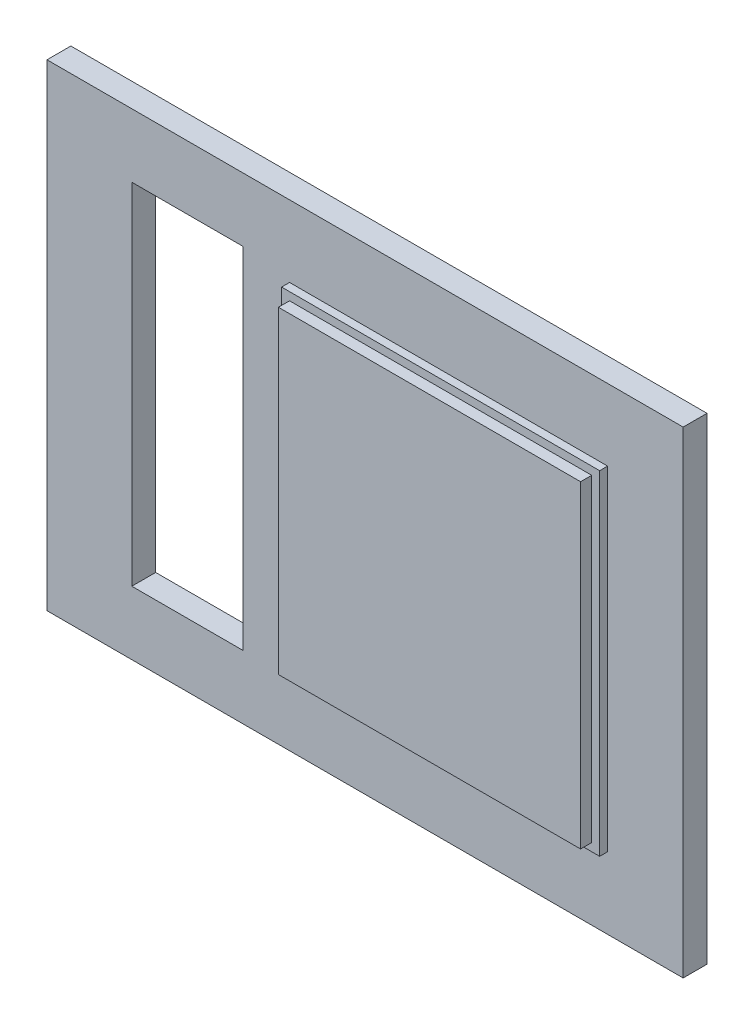
ISO-10303-21;
HEADER;
FILE_DESCRIPTION(('STEP AP214'),'2;1');
FILE_NAME('part.step','',(''),(''),'','','');
FILE_SCHEMA(('AUTOMOTIVE_DESIGN { 1 0 10303 214 1 1 1 1 }'));
ENDSEC;
DATA;
#1=APPLICATION_CONTEXT('core data for automotive mechanical design processes');
#2=APPLICATION_PROTOCOL_DEFINITION('international standard','automotive_design',2000,#1);
#3=PRODUCT_CONTEXT('',#1,'mechanical');
#4=PRODUCT('Part','Part','',(#3));
#5=PRODUCT_RELATED_PRODUCT_CATEGORY('part','',(#4));
#6=PRODUCT_DEFINITION_FORMATION('','',#4);
#7=PRODUCT_DEFINITION_CONTEXT('part definition',#1,'design');
#8=PRODUCT_DEFINITION('design','',#6,#7);
#9=PRODUCT_DEFINITION_SHAPE('','',#8);
#10=(LENGTH_UNIT() NAMED_UNIT(*) SI_UNIT(.MILLI.,.METRE.));
#11=(NAMED_UNIT(*) PLANE_ANGLE_UNIT() SI_UNIT($,.RADIAN.));
#12=(NAMED_UNIT(*) SI_UNIT($,.STERADIAN.) SOLID_ANGLE_UNIT());
#13=UNCERTAINTY_MEASURE_WITH_UNIT(LENGTH_MEASURE(1.E-05),#10,'distance_accuracy_value','');
#14=(GEOMETRIC_REPRESENTATION_CONTEXT(3) GLOBAL_UNCERTAINTY_ASSIGNED_CONTEXT((#13)) GLOBAL_UNIT_ASSIGNED_CONTEXT((#10,
#11,#12)) REPRESENTATION_CONTEXT('',''));
#15=CARTESIAN_POINT('',(0.,0.,0.));
#16=DIRECTION('',(0.,0.,1.));
#17=DIRECTION('',(1.,0.,0.));
#18=AXIS2_PLACEMENT_3D('',#15,#16,#17);
#19=CARTESIAN_POINT('',(0.,0.,2.));
#20=DIRECTION('',(0.,0.,1.));
#21=DIRECTION('',(1.,0.,0.));
#22=AXIS2_PLACEMENT_3D('',#19,#20,#21);
#23=PLANE('',#22);
#24=DIRECTION('',(0.,1.,0.));
#25=VECTOR('',#24,1.);
#26=CARTESIAN_POINT('',(15.25,10.5,2.));
#27=LINE('',#26,#25);
#28=CARTESIAN_POINT('',(15.25,-10.5,2.));
#29=VERTEX_POINT('',#28);
#30=CARTESIAN_POINT('',(15.25,10.5,2.));
#31=VERTEX_POINT('',#30);
#32=EDGE_CURVE('E211',#29,#31,#27,.T.);
#33=ORIENTED_EDGE('',*,*,#32,.T.);
#34=DIRECTION('',(-1.,0.,0.));
#35=VECTOR('',#34,1.);
#36=CARTESIAN_POINT('',(-4.75,10.5,2.));
#37=LINE('',#36,#35);
#38=CARTESIAN_POINT('',(-4.75,10.5,2.));
#39=VERTEX_POINT('',#38);
#40=EDGE_CURVE('E214',#31,#39,#37,.T.);
#41=ORIENTED_EDGE('',*,*,#40,.T.);
#42=DIRECTION('',(0.,-1.,0.));
#43=VECTOR('',#42,1.);
#44=CARTESIAN_POINT('',(-4.75,10.5,2.));
#45=LINE('',#44,#43);
#46=CARTESIAN_POINT('',(-4.75,-10.5,2.));
#47=VERTEX_POINT('',#46);
#48=EDGE_CURVE('E217',#39,#47,#45,.T.);
#49=ORIENTED_EDGE('',*,*,#48,.T.);
#50=DIRECTION('',(1.,0.,0.));
#51=VECTOR('',#50,1.);
#52=CARTESIAN_POINT('',(-4.75,-10.5,2.));
#53=LINE('',#52,#51);
#54=EDGE_CURVE('E219',#47,#29,#53,.T.);
#55=ORIENTED_EDGE('',*,*,#54,.T.);
#56=EDGE_LOOP('',(#33,#41,#49,#55));
#57=FACE_BOUND('',#56,.T.);
#58=DIRECTION('',(-1.,0.,0.));
#59=VECTOR('',#58,1.);
#60=CARTESIAN_POINT('',(-4.25,10.,2.));
#61=LINE('',#60,#59);
#62=CARTESIAN_POINT('',(14.75,10.,2.));
#63=VERTEX_POINT('',#62);
#64=CARTESIAN_POINT('',(-4.25,10.,2.));
#65=VERTEX_POINT('',#64);
#66=EDGE_CURVE('E195',#63,#65,#61,.T.);
#67=ORIENTED_EDGE('',*,*,#66,.F.);
#68=DIRECTION('',(0.,1.,0.));
#69=VECTOR('',#68,1.);
#70=CARTESIAN_POINT('',(14.75,10.,2.));
#71=LINE('',#70,#69);
#72=CARTESIAN_POINT('',(14.75,-10.,2.));
#73=VERTEX_POINT('',#72);
#74=EDGE_CURVE('E178',#73,#63,#71,.T.);
#75=ORIENTED_EDGE('',*,*,#74,.F.);
#76=DIRECTION('',(1.,0.,0.));
#77=VECTOR('',#76,1.);
#78=CARTESIAN_POINT('',(-4.24999999999999,-10.,2.));
#79=LINE('',#78,#77);
#80=CARTESIAN_POINT('',(-4.24999999999999,-10.,2.));
#81=VERTEX_POINT('',#80);
#82=EDGE_CURVE('E186',#81,#73,#79,.T.);
#83=ORIENTED_EDGE('',*,*,#82,.F.);
#84=DIRECTION('',(0.,-1.,0.));
#85=VECTOR('',#84,1.);
#86=CARTESIAN_POINT('',(-4.25,10.,2.));
#87=LINE('',#86,#85);
#88=EDGE_CURVE('E197',#65,#81,#87,.T.);
#89=ORIENTED_EDGE('',*,*,#88,.F.);
#90=EDGE_LOOP('',(#67,#75,#83,#89));
#91=FACE_BOUND('',#90,.T.);
#92=ADVANCED_FACE('F32',(#57,#91),#23,.T.);
#93=CARTESIAN_POINT('',(0.,0.,1.5));
#94=DIRECTION('',(0.,0.,1.));
#95=DIRECTION('',(1.,0.,0.));
#96=AXIS2_PLACEMENT_3D('',#93,#94,#95);
#97=PLANE('',#96);
#98=DIRECTION('',(0.,1.,0.));
#99=VECTOR('',#98,1.);
#100=CARTESIAN_POINT('',(-7.666666,11.,1.5));
#101=LINE('',#100,#99);
#102=CARTESIAN_POINT('',(-7.666666,-11.,1.5));
#103=VERTEX_POINT('',#102);
#104=CARTESIAN_POINT('',(-7.666666,11.,1.5));
#105=VERTEX_POINT('',#104);
#106=EDGE_CURVE('E47',#103,#105,#101,.T.);
#107=ORIENTED_EDGE('',*,*,#106,.F.);
#108=DIRECTION('',(1.,0.,0.));
#109=VECTOR('',#108,1.);
#110=CARTESIAN_POINT('',(-14.666666,-11.,1.5));
#111=LINE('',#110,#109);
#112=CARTESIAN_POINT('',(-14.666666,-11.,1.5));
#113=VERTEX_POINT('',#112);
#114=EDGE_CURVE('E163',#113,#103,#111,.T.);
#115=ORIENTED_EDGE('',*,*,#114,.F.);
#116=DIRECTION('',(0.,-1.,0.));
#117=VECTOR('',#116,1.);
#118=CARTESIAN_POINT('',(-14.666666,11.,1.5));
#119=LINE('',#118,#117);
#120=CARTESIAN_POINT('',(-14.666666,11.,1.5));
#121=VERTEX_POINT('',#120);
#122=EDGE_CURVE('E166',#121,#113,#119,.T.);
#123=ORIENTED_EDGE('',*,*,#122,.F.);
#124=DIRECTION('',(-1.,0.,0.));
#125=VECTOR('',#124,1.);
#126=CARTESIAN_POINT('',(-14.666666,11.,1.5));
#127=LINE('',#126,#125);
#128=EDGE_CURVE('E172',#105,#121,#127,.T.);
#129=ORIENTED_EDGE('',*,*,#128,.F.);
#130=EDGE_LOOP('',(#107,#115,#123,#129));
#131=FACE_BOUND('',#130,.T.);
#132=DIRECTION('',(0.,-1.,0.));
#133=VECTOR('',#132,1.);
#134=CARTESIAN_POINT('',(-20.,15.,1.5));
#135=LINE('',#134,#133);
#136=CARTESIAN_POINT('',(-20.,15.,1.5));
#137=VERTEX_POINT('',#136);
#138=CARTESIAN_POINT('',(-20.,-15.,1.5));
#139=VERTEX_POINT('',#138);
#140=EDGE_CURVE('E240',#137,#139,#135,.T.);
#141=ORIENTED_EDGE('',*,*,#140,.T.);
#142=DIRECTION('',(1.,0.,0.));
#143=VECTOR('',#142,1.);
#144=CARTESIAN_POINT('',(-20.,-15.,1.5));
#145=LINE('',#144,#143);
#146=CARTESIAN_POINT('',(20.,-15.,1.5));
#147=VERTEX_POINT('',#146);
#148=EDGE_CURVE('E243',#139,#147,#145,.T.);
#149=ORIENTED_EDGE('',*,*,#148,.T.);
#150=DIRECTION('',(0.,-1.,0.));
#151=VECTOR('',#150,1.);
#152=CARTESIAN_POINT('',(20.,15.,1.5));
#153=LINE('',#152,#151);
#154=CARTESIAN_POINT('',(20.,15.,1.5));
#155=VERTEX_POINT('',#154);
#156=EDGE_CURVE('E246',#155,#147,#153,.T.);
#157=ORIENTED_EDGE('',*,*,#156,.F.);
#158=DIRECTION('',(1.,0.,0.));
#159=VECTOR('',#158,1.);
#160=CARTESIAN_POINT('',(-20.,15.,1.5));
#161=LINE('',#160,#159);
#162=EDGE_CURVE('E249',#137,#155,#161,.T.);
#163=ORIENTED_EDGE('',*,*,#162,.F.);
#164=EDGE_LOOP('',(#141,#149,#157,#163));
#165=FACE_BOUND('',#164,.T.);
#166=DIRECTION('',(-1.,0.,0.));
#167=VECTOR('',#166,1.);
#168=CARTESIAN_POINT('',(-4.75,10.5,1.5));
#169=LINE('',#168,#167);
#170=CARTESIAN_POINT('',(15.25,10.5,1.5));
#171=VERTEX_POINT('',#170);
#172=CARTESIAN_POINT('',(-4.75,10.5,1.5));
#173=VERTEX_POINT('',#172);
#174=EDGE_CURVE('E224',#171,#173,#169,.T.);
#175=ORIENTED_EDGE('',*,*,#174,.F.);
#176=DIRECTION('',(0.,1.,0.));
#177=VECTOR('',#176,1.);
#178=CARTESIAN_POINT('',(15.25,10.5,1.5));
#179=LINE('',#178,#177);
#180=CARTESIAN_POINT('',(15.25,-10.5,1.5));
#181=VERTEX_POINT('',#180);
#182=EDGE_CURVE('E210',#181,#171,#179,.T.);
#183=ORIENTED_EDGE('',*,*,#182,.F.);
#184=DIRECTION('',(1.,0.,0.));
#185=VECTOR('',#184,1.);
#186=CARTESIAN_POINT('',(-4.75,-10.5,1.5));
#187=LINE('',#186,#185);
#188=CARTESIAN_POINT('',(-4.75,-10.5,1.5));
#189=VERTEX_POINT('',#188);
#190=EDGE_CURVE('E215',#189,#181,#187,.T.);
#191=ORIENTED_EDGE('',*,*,#190,.F.);
#192=DIRECTION('',(0.,-1.,0.));
#193=VECTOR('',#192,1.);
#194=CARTESIAN_POINT('',(-4.75,10.5,1.5));
#195=LINE('',#194,#193);
#196=EDGE_CURVE('E226',#173,#189,#195,.T.);
#197=ORIENTED_EDGE('',*,*,#196,.F.);
#198=EDGE_LOOP('',(#175,#183,#191,#197));
#199=FACE_BOUND('',#198,.T.);
#200=ADVANCED_FACE('F280',(#131,#165,#199),#97,.T.);
#201=CARTESIAN_POINT('',(-20.,15.,1.5));
#202=DIRECTION('',(1.,0.,0.));
#203=DIRECTION('',(0.,1.,0.));
#204=AXIS2_PLACEMENT_3D('',#201,#202,#203);
#205=PLANE('',#204);
#206=DIRECTION('',(0.,-1.,0.));
#207=VECTOR('',#206,1.);
#208=CARTESIAN_POINT('',(-20.,15.,0.));
#209=LINE('',#208,#207);
#210=CARTESIAN_POINT('',(-20.,15.,0.));
#211=VERTEX_POINT('',#210);
#212=CARTESIAN_POINT('',(-20.,-15.,0.));
#213=VERTEX_POINT('',#212);
#214=EDGE_CURVE('E239',#211,#213,#209,.T.);
#215=ORIENTED_EDGE('',*,*,#214,.T.);
#216=DIRECTION('',(0.,0.,-1.));
#217=VECTOR('',#216,1.);
#218=CARTESIAN_POINT('',(-20.,-15.,1.5));
#219=LINE('',#218,#217);
#220=EDGE_CURVE('E11',#139,#213,#219,.T.);
#221=ORIENTED_EDGE('',*,*,#220,.F.);
#222=ORIENTED_EDGE('',*,*,#140,.F.);
#223=DIRECTION('',(0.,0.,-1.));
#224=VECTOR('',#223,1.);
#225=CARTESIAN_POINT('',(-20.,15.,1.5));
#226=LINE('',#225,#224);
#227=EDGE_CURVE('E252',#137,#211,#226,.T.);
#228=ORIENTED_EDGE('',*,*,#227,.T.);
#229=EDGE_LOOP('',(#215,#221,#222,#228));
#230=FACE_BOUND('',#229,.T.);
#231=ADVANCED_FACE('F34',(#230),#205,.F.);
#232=CARTESIAN_POINT('',(-20.,-15.,1.5));
#233=DIRECTION('',(0.,1.,0.));
#234=DIRECTION('',(0.,0.,1.));
#235=AXIS2_PLACEMENT_3D('',#232,#233,#234);
#236=PLANE('',#235);
#237=DIRECTION('',(1.,0.,0.));
#238=VECTOR('',#237,1.);
#239=CARTESIAN_POINT('',(-20.,-15.,0.));
#240=LINE('',#239,#238);
#241=CARTESIAN_POINT('',(20.,-15.,0.));
#242=VERTEX_POINT('',#241);
#243=EDGE_CURVE('E255',#213,#242,#240,.T.);
#244=ORIENTED_EDGE('',*,*,#243,.T.);
#245=DIRECTION('',(0.,0.,-1.));
#246=VECTOR('',#245,1.);
#247=CARTESIAN_POINT('',(20.,-15.,1.5));
#248=LINE('',#247,#246);
#249=EDGE_CURVE('E40',#147,#242,#248,.T.);
#250=ORIENTED_EDGE('',*,*,#249,.F.);
#251=ORIENTED_EDGE('',*,*,#148,.F.);
#252=ORIENTED_EDGE('',*,*,#220,.T.);
#253=EDGE_LOOP('',(#244,#250,#251,#252));
#254=FACE_BOUND('',#253,.T.);
#255=ADVANCED_FACE('F271',(#254),#236,.F.);
#256=CARTESIAN_POINT('',(20.,15.,1.5));
#257=DIRECTION('',(1.,0.,0.));
#258=DIRECTION('',(0.,1.,0.));
#259=AXIS2_PLACEMENT_3D('',#256,#257,#258);
#260=PLANE('',#259);
#261=DIRECTION('',(0.,-1.,0.));
#262=VECTOR('',#261,1.);
#263=CARTESIAN_POINT('',(20.,15.,0.));
#264=LINE('',#263,#262);
#265=CARTESIAN_POINT('',(20.,15.,0.));
#266=VERTEX_POINT('',#265);
#267=EDGE_CURVE('E258',#266,#242,#264,.T.);
#268=ORIENTED_EDGE('',*,*,#267,.F.);
#269=DIRECTION('',(0.,0.,-1.));
#270=VECTOR('',#269,1.);
#271=CARTESIAN_POINT('',(20.,15.,1.5));
#272=LINE('',#271,#270);
#273=EDGE_CURVE('E264',#155,#266,#272,.T.);
#274=ORIENTED_EDGE('',*,*,#273,.F.);
#275=ORIENTED_EDGE('',*,*,#156,.T.);
#276=ORIENTED_EDGE('',*,*,#249,.T.);
#277=EDGE_LOOP('',(#268,#274,#275,#276));
#278=FACE_BOUND('',#277,.T.);
#279=ADVANCED_FACE('F268',(#278),#260,.T.);
#280=CARTESIAN_POINT('',(-20.,15.,1.5));
#281=DIRECTION('',(0.,1.,0.));
#282=DIRECTION('',(0.,0.,1.));
#283=AXIS2_PLACEMENT_3D('',#280,#281,#282);
#284=PLANE('',#283);
#285=DIRECTION('',(1.,0.,0.));
#286=VECTOR('',#285,1.);
#287=CARTESIAN_POINT('',(-20.,15.,0.));
#288=LINE('',#287,#286);
#289=EDGE_CURVE('E244',#211,#266,#288,.T.);
#290=ORIENTED_EDGE('',*,*,#289,.F.);
#291=ORIENTED_EDGE('',*,*,#227,.F.);
#292=ORIENTED_EDGE('',*,*,#162,.T.);
#293=ORIENTED_EDGE('',*,*,#273,.T.);
#294=EDGE_LOOP('',(#290,#291,#292,#293));
#295=FACE_BOUND('',#294,.T.);
#296=ADVANCED_FACE('F276',(#295),#284,.T.);
#297=CARTESIAN_POINT('',(0.,0.,0.));
#298=DIRECTION('',(0.,0.,1.));
#299=DIRECTION('',(1.,0.,0.));
#300=AXIS2_PLACEMENT_3D('',#297,#298,#299);
#301=PLANE('',#300);
#302=DIRECTION('',(1.,0.,0.));
#303=VECTOR('',#302,1.);
#304=CARTESIAN_POINT('',(-14.666666,-11.,0.));
#305=LINE('',#304,#303);
#306=CARTESIAN_POINT('',(-14.666666,-11.,0.));
#307=VERTEX_POINT('',#306);
#308=CARTESIAN_POINT('',(-7.666666,-11.,0.));
#309=VERTEX_POINT('',#308);
#310=EDGE_CURVE('E153',#307,#309,#305,.T.);
#311=ORIENTED_EDGE('',*,*,#310,.T.);
#312=DIRECTION('',(0.,1.,0.));
#313=VECTOR('',#312,1.);
#314=CARTESIAN_POINT('',(-7.666666,11.,0.));
#315=LINE('',#314,#313);
#316=CARTESIAN_POINT('',(-7.666666,11.,0.));
#317=VERTEX_POINT('',#316);
#318=EDGE_CURVE('E147',#309,#317,#315,.T.);
#319=ORIENTED_EDGE('',*,*,#318,.T.);
#320=DIRECTION('',(-1.,0.,0.));
#321=VECTOR('',#320,1.);
#322=CARTESIAN_POINT('',(-14.666666,11.,0.));
#323=LINE('',#322,#321);
#324=CARTESIAN_POINT('',(-14.666666,11.,0.));
#325=VERTEX_POINT('',#324);
#326=EDGE_CURVE('E156',#317,#325,#323,.T.);
#327=ORIENTED_EDGE('',*,*,#326,.T.);
#328=DIRECTION('',(0.,-1.,0.));
#329=VECTOR('',#328,1.);
#330=CARTESIAN_POINT('',(-14.666666,11.,0.));
#331=LINE('',#330,#329);
#332=EDGE_CURVE('E55',#325,#307,#331,.T.);
#333=ORIENTED_EDGE('',*,*,#332,.T.);
#334=EDGE_LOOP('',(#311,#319,#327,#333));
#335=FACE_BOUND('',#334,.T.);
#336=ORIENTED_EDGE('',*,*,#214,.F.);
#337=ORIENTED_EDGE('',*,*,#289,.T.);
#338=ORIENTED_EDGE('',*,*,#267,.T.);
#339=ORIENTED_EDGE('',*,*,#243,.F.);
#340=EDGE_LOOP('',(#336,#337,#338,#339));
#341=FACE_BOUND('',#340,.T.);
#342=ADVANCED_FACE('F160',(#335,#341),#301,.F.);
#343=CARTESIAN_POINT('',(15.25,10.5,2.));
#344=DIRECTION('',(-1.,0.,0.));
#345=DIRECTION('',(0.,-1.,0.));
#346=AXIS2_PLACEMENT_3D('',#343,#344,#345);
#347=PLANE('',#346);
#348=ORIENTED_EDGE('',*,*,#182,.T.);
#349=DIRECTION('',(0.,0.,-1.));
#350=VECTOR('',#349,1.);
#351=CARTESIAN_POINT('',(15.25,10.5,2.));
#352=LINE('',#351,#350);
#353=EDGE_CURVE('E237',#31,#171,#352,.T.);
#354=ORIENTED_EDGE('',*,*,#353,.F.);
#355=ORIENTED_EDGE('',*,*,#32,.F.);
#356=DIRECTION('',(0.,0.,-1.));
#357=VECTOR('',#356,1.);
#358=CARTESIAN_POINT('',(15.25,-10.5,2.));
#359=LINE('',#358,#357);
#360=EDGE_CURVE('E221',#29,#181,#359,.T.);
#361=ORIENTED_EDGE('',*,*,#360,.T.);
#362=EDGE_LOOP('',(#348,#354,#355,#361));
#363=FACE_BOUND('',#362,.T.);
#364=ADVANCED_FACE('F311',(#363),#347,.F.);
#365=CARTESIAN_POINT('',(-4.75,10.5,2.));
#366=DIRECTION('',(0.,-1.,0.));
#367=DIRECTION('',(0.,0.,-1.));
#368=AXIS2_PLACEMENT_3D('',#365,#366,#367);
#369=PLANE('',#368);
#370=ORIENTED_EDGE('',*,*,#174,.T.);
#371=DIRECTION('',(0.,0.,-1.));
#372=VECTOR('',#371,1.);
#373=CARTESIAN_POINT('',(-4.75,10.5,2.));
#374=LINE('',#373,#372);
#375=EDGE_CURVE('E234',#39,#173,#374,.T.);
#376=ORIENTED_EDGE('',*,*,#375,.F.);
#377=ORIENTED_EDGE('',*,*,#40,.F.);
#378=ORIENTED_EDGE('',*,*,#353,.T.);
#379=EDGE_LOOP('',(#370,#376,#377,#378));
#380=FACE_BOUND('',#379,.T.);
#381=ADVANCED_FACE('F307',(#380),#369,.F.);
#382=CARTESIAN_POINT('',(-4.75,10.5,2.));
#383=DIRECTION('',(1.,0.,0.));
#384=DIRECTION('',(0.,1.,0.));
#385=AXIS2_PLACEMENT_3D('',#382,#383,#384);
#386=PLANE('',#385);
#387=ORIENTED_EDGE('',*,*,#196,.T.);
#388=DIRECTION('',(0.,0.,-1.));
#389=VECTOR('',#388,1.);
#390=CARTESIAN_POINT('',(-4.75,-10.5,2.));
#391=LINE('',#390,#389);
#392=EDGE_CURVE('E232',#47,#189,#391,.T.);
#393=ORIENTED_EDGE('',*,*,#392,.F.);
#394=ORIENTED_EDGE('',*,*,#48,.F.);
#395=ORIENTED_EDGE('',*,*,#375,.T.);
#396=EDGE_LOOP('',(#387,#393,#394,#395));
#397=FACE_BOUND('',#396,.T.);
#398=ADVANCED_FACE('F303',(#397),#386,.F.);
#399=CARTESIAN_POINT('',(-4.75,-10.5,2.));
#400=DIRECTION('',(0.,1.,0.));
#401=DIRECTION('',(0.,0.,1.));
#402=AXIS2_PLACEMENT_3D('',#399,#400,#401);
#403=PLANE('',#402);
#404=ORIENTED_EDGE('',*,*,#190,.T.);
#405=ORIENTED_EDGE('',*,*,#360,.F.);
#406=ORIENTED_EDGE('',*,*,#54,.F.);
#407=ORIENTED_EDGE('',*,*,#392,.T.);
#408=EDGE_LOOP('',(#404,#405,#406,#407));
#409=FACE_BOUND('',#408,.T.);
#410=ADVANCED_FACE('F300',(#409),#403,.F.);
#411=CARTESIAN_POINT('',(14.75,10.,2.7));
#412=DIRECTION('',(-1.,0.,0.));
#413=DIRECTION('',(0.,-1.,0.));
#414=AXIS2_PLACEMENT_3D('',#411,#412,#413);
#415=PLANE('',#414);
#416=ORIENTED_EDGE('',*,*,#74,.T.);
#417=DIRECTION('',(0.,0.,-1.));
#418=VECTOR('',#417,1.);
#419=CARTESIAN_POINT('',(14.75,10.,2.7));
#420=LINE('',#419,#418);
#421=CARTESIAN_POINT('',(14.75,10.,2.7));
#422=VERTEX_POINT('',#421);
#423=EDGE_CURVE('E208',#422,#63,#420,.T.);
#424=ORIENTED_EDGE('',*,*,#423,.F.);
#425=DIRECTION('',(0.,1.,0.));
#426=VECTOR('',#425,1.);
#427=CARTESIAN_POINT('',(14.75,10.,2.7));
#428=LINE('',#427,#426);
#429=CARTESIAN_POINT('',(14.75,-10.,2.7));
#430=VERTEX_POINT('',#429);
#431=EDGE_CURVE('E182',#430,#422,#428,.T.);
#432=ORIENTED_EDGE('',*,*,#431,.F.);
#433=DIRECTION('',(0.,0.,-1.));
#434=VECTOR('',#433,1.);
#435=CARTESIAN_POINT('',(14.75,-10.,2.7));
#436=LINE('',#435,#434);
#437=EDGE_CURVE('E192',#430,#73,#436,.T.);
#438=ORIENTED_EDGE('',*,*,#437,.T.);
#439=EDGE_LOOP('',(#416,#424,#432,#438));
#440=FACE_BOUND('',#439,.T.);
#441=ADVANCED_FACE('F298',(#440),#415,.F.);
#442=CARTESIAN_POINT('',(-4.25,10.,2.7));
#443=DIRECTION('',(0.,-1.,0.));
#444=DIRECTION('',(0.,0.,-1.));
#445=AXIS2_PLACEMENT_3D('',#442,#443,#444);
#446=PLANE('',#445);
#447=ORIENTED_EDGE('',*,*,#66,.T.);
#448=DIRECTION('',(0.,0.,-1.));
#449=VECTOR('',#448,1.);
#450=CARTESIAN_POINT('',(-4.25,10.,2.7));
#451=LINE('',#450,#449);
#452=CARTESIAN_POINT('',(-4.25,10.,2.7));
#453=VERTEX_POINT('',#452);
#454=EDGE_CURVE('E205',#453,#65,#451,.T.);
#455=ORIENTED_EDGE('',*,*,#454,.F.);
#456=DIRECTION('',(-1.,0.,0.));
#457=VECTOR('',#456,1.);
#458=CARTESIAN_POINT('',(-4.25,10.,2.7));
#459=LINE('',#458,#457);
#460=EDGE_CURVE('E185',#422,#453,#459,.T.);
#461=ORIENTED_EDGE('',*,*,#460,.F.);
#462=ORIENTED_EDGE('',*,*,#423,.T.);
#463=EDGE_LOOP('',(#447,#455,#461,#462));
#464=FACE_BOUND('',#463,.T.);
#465=ADVANCED_FACE('F357',(#464),#446,.F.);
#466=CARTESIAN_POINT('',(-4.25,10.,2.7));
#467=DIRECTION('',(1.,0.,0.));
#468=DIRECTION('',(0.,1.,0.));
#469=AXIS2_PLACEMENT_3D('',#466,#467,#468);
#470=PLANE('',#469);
#471=ORIENTED_EDGE('',*,*,#88,.T.);
#472=DIRECTION('',(0.,0.,-1.));
#473=VECTOR('',#472,1.);
#474=CARTESIAN_POINT('',(-4.24999999999999,-10.,2.7));
#475=LINE('',#474,#473);
#476=CARTESIAN_POINT('',(-4.24999999999999,-10.,2.7));
#477=VERTEX_POINT('',#476);
#478=EDGE_CURVE('E203',#477,#81,#475,.T.);
#479=ORIENTED_EDGE('',*,*,#478,.F.);
#480=DIRECTION('',(0.,-1.,0.));
#481=VECTOR('',#480,1.);
#482=CARTESIAN_POINT('',(-4.25,10.,2.7));
#483=LINE('',#482,#481);
#484=EDGE_CURVE('E188',#453,#477,#483,.T.);
#485=ORIENTED_EDGE('',*,*,#484,.F.);
#486=ORIENTED_EDGE('',*,*,#454,.T.);
#487=EDGE_LOOP('',(#471,#479,#485,#486));
#488=FACE_BOUND('',#487,.T.);
#489=ADVANCED_FACE('F364',(#488),#470,.F.);
#490=CARTESIAN_POINT('',(-4.24999999999999,-10.,2.7));
#491=DIRECTION('',(0.,1.,0.));
#492=DIRECTION('',(0.,0.,1.));
#493=AXIS2_PLACEMENT_3D('',#490,#491,#492);
#494=PLANE('',#493);
#495=ORIENTED_EDGE('',*,*,#82,.T.);
#496=ORIENTED_EDGE('',*,*,#437,.F.);
#497=DIRECTION('',(1.,0.,0.));
#498=VECTOR('',#497,1.);
#499=CARTESIAN_POINT('',(-4.24999999999999,-10.,2.7));
#500=LINE('',#499,#498);
#501=EDGE_CURVE('E190',#477,#430,#500,.T.);
#502=ORIENTED_EDGE('',*,*,#501,.F.);
#503=ORIENTED_EDGE('',*,*,#478,.T.);
#504=EDGE_LOOP('',(#495,#496,#502,#503));
#505=FACE_BOUND('',#504,.T.);
#506=ADVANCED_FACE('F371',(#505),#494,.F.);
#507=CARTESIAN_POINT('',(0.,0.,2.7));
#508=DIRECTION('',(0.,0.,1.));
#509=DIRECTION('',(1.,0.,0.));
#510=AXIS2_PLACEMENT_3D('',#507,#508,#509);
#511=PLANE('',#510);
#512=ORIENTED_EDGE('',*,*,#431,.T.);
#513=ORIENTED_EDGE('',*,*,#460,.T.);
#514=ORIENTED_EDGE('',*,*,#484,.T.);
#515=ORIENTED_EDGE('',*,*,#501,.T.);
#516=EDGE_LOOP('',(#512,#513,#514,#515));
#517=FACE_BOUND('',#516,.T.);
#518=ADVANCED_FACE('F379',(#517),#511,.T.);
#519=CARTESIAN_POINT('',(-7.666666,11.,0.));
#520=DIRECTION('',(1.,0.,0.));
#521=DIRECTION('',(0.,1.,0.));
#522=AXIS2_PLACEMENT_3D('',#519,#520,#521);
#523=PLANE('',#522);
#524=ORIENTED_EDGE('',*,*,#106,.T.);
#525=DIRECTION('',(0.,0.,1.));
#526=VECTOR('',#525,1.);
#527=CARTESIAN_POINT('',(-7.666666,11.,0.));
#528=LINE('',#527,#526);
#529=EDGE_CURVE('E143',#317,#105,#528,.T.);
#530=ORIENTED_EDGE('',*,*,#529,.F.);
#531=ORIENTED_EDGE('',*,*,#318,.F.);
#532=DIRECTION('',(0.,0.,1.));
#533=VECTOR('',#532,1.);
#534=CARTESIAN_POINT('',(-7.666666,-11.,0.));
#535=LINE('',#534,#533);
#536=EDGE_CURVE('E176',#309,#103,#535,.T.);
#537=ORIENTED_EDGE('',*,*,#536,.T.);
#538=EDGE_LOOP('',(#524,#530,#531,#537));
#539=FACE_BOUND('',#538,.T.);
#540=ADVANCED_FACE('F145',(#539),#523,.F.);
#541=CARTESIAN_POINT('',(-14.666666,-11.,0.));
#542=DIRECTION('',(0.,-1.,0.));
#543=DIRECTION('',(0.,0.,-1.));
#544=AXIS2_PLACEMENT_3D('',#541,#542,#543);
#545=PLANE('',#544);
#546=ORIENTED_EDGE('',*,*,#114,.T.);
#547=ORIENTED_EDGE('',*,*,#536,.F.);
#548=ORIENTED_EDGE('',*,*,#310,.F.);
#549=DIRECTION('',(0.,0.,1.));
#550=VECTOR('',#549,1.);
#551=CARTESIAN_POINT('',(-14.666666,-11.,0.));
#552=LINE('',#551,#550);
#553=EDGE_CURVE('E179',#307,#113,#552,.T.);
#554=ORIENTED_EDGE('',*,*,#553,.T.);
#555=EDGE_LOOP('',(#546,#547,#548,#554));
#556=FACE_BOUND('',#555,.T.);
#557=ADVANCED_FACE('F393',(#556),#545,.F.);
#558=CARTESIAN_POINT('',(-14.666666,11.,0.));
#559=DIRECTION('',(-1.,0.,0.));
#560=DIRECTION('',(0.,-1.,0.));
#561=AXIS2_PLACEMENT_3D('',#558,#559,#560);
#562=PLANE('',#561);
#563=ORIENTED_EDGE('',*,*,#122,.T.);
#564=ORIENTED_EDGE('',*,*,#553,.F.);
#565=ORIENTED_EDGE('',*,*,#332,.F.);
#566=DIRECTION('',(0.,0.,1.));
#567=VECTOR('',#566,1.);
#568=CARTESIAN_POINT('',(-14.666666,11.,0.));
#569=LINE('',#568,#567);
#570=EDGE_CURVE('E152',#325,#121,#569,.T.);
#571=ORIENTED_EDGE('',*,*,#570,.T.);
#572=EDGE_LOOP('',(#563,#564,#565,#571));
#573=FACE_BOUND('',#572,.T.);
#574=ADVANCED_FACE('F400',(#573),#562,.F.);
#575=CARTESIAN_POINT('',(-14.666666,11.,0.));
#576=DIRECTION('',(0.,1.,0.));
#577=DIRECTION('',(0.,0.,1.));
#578=AXIS2_PLACEMENT_3D('',#575,#576,#577);
#579=PLANE('',#578);
#580=ORIENTED_EDGE('',*,*,#128,.T.);
#581=ORIENTED_EDGE('',*,*,#570,.F.);
#582=ORIENTED_EDGE('',*,*,#326,.F.);
#583=ORIENTED_EDGE('',*,*,#529,.T.);
#584=EDGE_LOOP('',(#580,#581,#582,#583));
#585=FACE_BOUND('',#584,.T.);
#586=ADVANCED_FACE('F157',(#585),#579,.F.);
#587=CLOSED_SHELL('',(#92,#200,#231,#255,#279,#296,#342,#364,#381,#398,#410,#441,#465,#489,#506,
#518,#540,#557,#574,#586));
#588=MANIFOLD_SOLID_BREP('B2',#587);
#589=ADVANCED_BREP_SHAPE_REPRESENTATION('',(#18,#588),#14);
#590=SHAPE_DEFINITION_REPRESENTATION(#9,#589);
ENDSEC;
END-ISO-10303-21;
